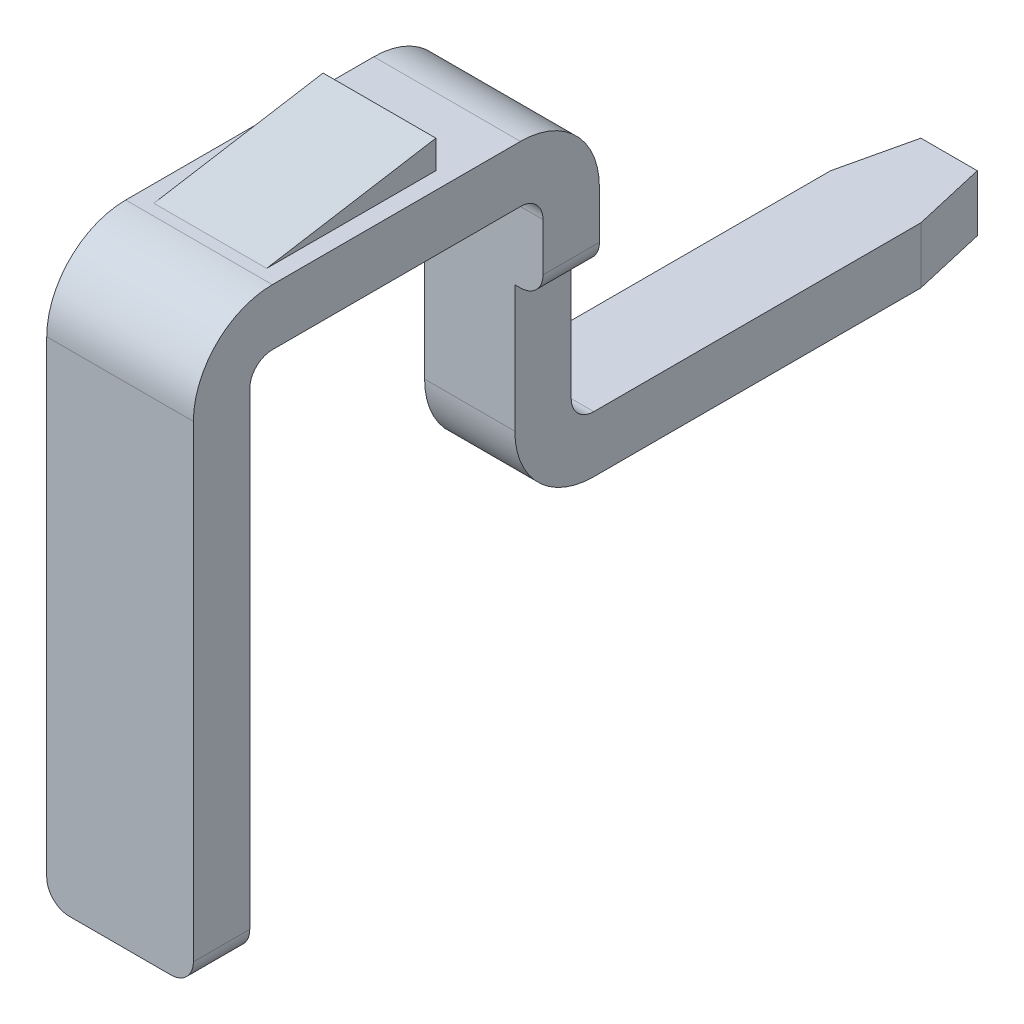
ISO-10303-21;
HEADER;
FILE_DESCRIPTION(('STEP AP214'),'2;1');
FILE_NAME('part.step','',(''),(''),'','','');
FILE_SCHEMA(('AUTOMOTIVE_DESIGN { 1 0 10303 214 1 1 1 1 }'));
ENDSEC;
DATA;
#1=APPLICATION_CONTEXT('core data for automotive mechanical design processes');
#2=APPLICATION_PROTOCOL_DEFINITION('international standard','automotive_design',2000,#1);
#3=PRODUCT_CONTEXT('',#1,'mechanical');
#4=PRODUCT('Part','Part','',(#3));
#5=PRODUCT_RELATED_PRODUCT_CATEGORY('part','',(#4));
#6=PRODUCT_DEFINITION_FORMATION('','',#4);
#7=PRODUCT_DEFINITION_CONTEXT('part definition',#1,'design');
#8=PRODUCT_DEFINITION('design','',#6,#7);
#9=PRODUCT_DEFINITION_SHAPE('','',#8);
#10=(LENGTH_UNIT() NAMED_UNIT(*) SI_UNIT(.MILLI.,.METRE.));
#11=(NAMED_UNIT(*) PLANE_ANGLE_UNIT() SI_UNIT($,.RADIAN.));
#12=(NAMED_UNIT(*) SI_UNIT($,.STERADIAN.) SOLID_ANGLE_UNIT());
#13=UNCERTAINTY_MEASURE_WITH_UNIT(LENGTH_MEASURE(1.E-05),#10,'distance_accuracy_value','');
#14=(GEOMETRIC_REPRESENTATION_CONTEXT(3) GLOBAL_UNCERTAINTY_ASSIGNED_CONTEXT((#13)) GLOBAL_UNIT_ASSIGNED_CONTEXT((#10,
#11,#12)) REPRESENTATION_CONTEXT('',''));
#15=CARTESIAN_POINT('',(0.,0.,0.));
#16=DIRECTION('',(0.,0.,1.));
#17=DIRECTION('',(1.,0.,0.));
#18=AXIS2_PLACEMENT_3D('',#15,#16,#17);
#19=CARTESIAN_POINT('',(-0.45,-1.95,3.8));
#20=DIRECTION('',(0.,0.,1.));
#21=DIRECTION('',(1.,0.,0.));
#22=AXIS2_PLACEMENT_3D('',#19,#20,#21);
#23=CYLINDRICAL_SURFACE('',#22,0.2);
#24=CARTESIAN_POINT('',(-0.45,-1.95,3.8));
#25=DIRECTION('',(0.,0.,1.));
#26=DIRECTION('',(1.,0.,0.));
#27=AXIS2_PLACEMENT_3D('',#24,#25,#26);
#28=CIRCLE('',#27,0.2);
#29=CARTESIAN_POINT('',(-0.65,-1.95,3.8));
#30=VERTEX_POINT('',#29);
#31=CARTESIAN_POINT('',(-0.45,-2.15,3.8));
#32=VERTEX_POINT('',#31);
#33=EDGE_CURVE('E334',#30,#32,#28,.T.);
#34=ORIENTED_EDGE('',*,*,#33,.F.);
#35=DIRECTION('',(0.,0.,1.));
#36=VECTOR('',#35,1.);
#37=CARTESIAN_POINT('',(-0.65,-1.95,3.8));
#38=LINE('',#37,#36);
#39=CARTESIAN_POINT('',(-0.65,-1.95,3.3));
#40=VERTEX_POINT('',#39);
#41=EDGE_CURVE('E313',#40,#30,#38,.T.);
#42=ORIENTED_EDGE('',*,*,#41,.F.);
#43=CARTESIAN_POINT('',(-0.45,-1.95,3.3));
#44=DIRECTION('',(0.,0.,-1.));
#45=DIRECTION('',(-1.,0.,0.));
#46=AXIS2_PLACEMENT_3D('',#43,#44,#45);
#47=CIRCLE('',#46,0.2);
#48=CARTESIAN_POINT('',(-0.45,-2.15,3.3));
#49=VERTEX_POINT('',#48);
#50=EDGE_CURVE('E463',#49,#40,#47,.T.);
#51=ORIENTED_EDGE('',*,*,#50,.F.);
#52=DIRECTION('',(0.,0.,-1.));
#53=VECTOR('',#52,1.);
#54=CARTESIAN_POINT('',(-0.45,-2.15,3.3));
#55=LINE('',#54,#53);
#56=EDGE_CURVE('E398',#32,#49,#55,.T.);
#57=ORIENTED_EDGE('',*,*,#56,.F.);
#58=EDGE_LOOP('',(#34,#42,#51,#57));
#59=FACE_BOUND('',#58,.T.);
#60=ADVANCED_FACE('F16',(#59),#23,.T.);
#61=CARTESIAN_POINT('',(0.45,-1.95,0.7));
#62=DIRECTION('',(0.,0.,1.));
#63=DIRECTION('',(1.,0.,0.));
#64=AXIS2_PLACEMENT_3D('',#61,#62,#63);
#65=CYLINDRICAL_SURFACE('',#64,0.2);
#66=CARTESIAN_POINT('',(0.45,-1.95,3.8));
#67=DIRECTION('',(0.,0.,1.));
#68=DIRECTION('',(1.,0.,0.));
#69=AXIS2_PLACEMENT_3D('',#66,#67,#68);
#70=CIRCLE('',#69,0.2);
#71=CARTESIAN_POINT('',(0.45,-2.15,3.8));
#72=VERTEX_POINT('',#71);
#73=CARTESIAN_POINT('',(0.65,-1.95,3.8));
#74=VERTEX_POINT('',#73);
#75=EDGE_CURVE('E423',#72,#74,#70,.T.);
#76=ORIENTED_EDGE('',*,*,#75,.F.);
#77=DIRECTION('',(0.,0.,1.));
#78=VECTOR('',#77,1.);
#79=CARTESIAN_POINT('',(0.45,-2.15,3.8));
#80=LINE('',#79,#78);
#81=CARTESIAN_POINT('',(0.45,-2.15,3.3));
#82=VERTEX_POINT('',#81);
#83=EDGE_CURVE('E289',#82,#72,#80,.T.);
#84=ORIENTED_EDGE('',*,*,#83,.F.);
#85=CARTESIAN_POINT('',(0.45,-1.95,3.3));
#86=DIRECTION('',(0.,0.,-1.));
#87=DIRECTION('',(-1.,0.,0.));
#88=AXIS2_PLACEMENT_3D('',#85,#86,#87);
#89=CIRCLE('',#88,0.2);
#90=CARTESIAN_POINT('',(0.65,-1.95,3.3));
#91=VERTEX_POINT('',#90);
#92=EDGE_CURVE('E462',#91,#82,#89,.T.);
#93=ORIENTED_EDGE('',*,*,#92,.F.);
#94=DIRECTION('',(0.,0.,-1.));
#95=VECTOR('',#94,1.);
#96=CARTESIAN_POINT('',(0.65,-1.95,3.3));
#97=LINE('',#96,#95);
#98=EDGE_CURVE('E311',#74,#91,#97,.T.);
#99=ORIENTED_EDGE('',*,*,#98,.F.);
#100=EDGE_LOOP('',(#76,#84,#93,#99));
#101=FACE_BOUND('',#100,.T.);
#102=ADVANCED_FACE('F618',(#101),#65,.T.);
#103=CARTESIAN_POINT('',(-0.5,3.15,1.5));
#104=DIRECTION('',(0.,-0.986393923832144,-0.164398987305357));
#105=DIRECTION('',(0.,0.164398987305357,-0.986393923832144));
#106=AXIS2_PLACEMENT_3D('',#103,#104,#105);
#107=PLANE('',#106);
#108=DIRECTION('',(0.,0.164398987305357,-0.986393923832144));
#109=VECTOR('',#108,1.);
#110=CARTESIAN_POINT('',(0.5,3.15,1.5));
#111=LINE('',#110,#109);
#112=CARTESIAN_POINT('',(0.5,2.9,3.));
#113=VERTEX_POINT('',#112);
#114=CARTESIAN_POINT('',(0.5,3.15,1.5));
#115=VERTEX_POINT('',#114);
#116=EDGE_CURVE('E411',#113,#115,#111,.T.);
#117=ORIENTED_EDGE('',*,*,#116,.T.);
#118=DIRECTION('',(-1.,0.,0.));
#119=VECTOR('',#118,1.);
#120=CARTESIAN_POINT('',(0.5,3.15,1.5));
#121=LINE('',#120,#119);
#122=CARTESIAN_POINT('',(-0.5,3.15,1.5));
#123=VERTEX_POINT('',#122);
#124=EDGE_CURVE('E27',#115,#123,#121,.T.);
#125=ORIENTED_EDGE('',*,*,#124,.T.);
#126=DIRECTION('',(0.,0.164398987305357,-0.986393923832144));
#127=VECTOR('',#126,1.);
#128=CARTESIAN_POINT('',(-0.5,3.15,1.5));
#129=LINE('',#128,#127);
#130=CARTESIAN_POINT('',(-0.5,2.9,3.));
#131=VERTEX_POINT('',#130);
#132=EDGE_CURVE('E11',#131,#123,#129,.T.);
#133=ORIENTED_EDGE('',*,*,#132,.F.);
#134=DIRECTION('',(1.,0.,0.));
#135=VECTOR('',#134,1.);
#136=CARTESIAN_POINT('',(-0.5,2.9,3.));
#137=LINE('',#136,#135);
#138=EDGE_CURVE('E406',#131,#113,#137,.T.);
#139=ORIENTED_EDGE('',*,*,#138,.T.);
#140=EDGE_LOOP('',(#117,#125,#133,#139));
#141=FACE_BOUND('',#140,.T.);
#142=ADVANCED_FACE('F1175',(#141),#107,.F.);
#143=CARTESIAN_POINT('',(-0.5,3.15,1.5));
#144=DIRECTION('',(1.,0.,0.));
#145=DIRECTION('',(0.,0.,-1.));
#146=AXIS2_PLACEMENT_3D('',#143,#144,#145);
#147=PLANE('',#146);
#148=DIRECTION('',(0.,0.,1.));
#149=VECTOR('',#148,1.);
#150=CARTESIAN_POINT('',(-0.5,2.9,1.5));
#151=LINE('',#150,#149);
#152=CARTESIAN_POINT('',(-0.5,2.9,1.5));
#153=VERTEX_POINT('',#152);
#154=EDGE_CURVE('E422',#153,#131,#151,.T.);
#155=ORIENTED_EDGE('',*,*,#154,.T.);
#156=ORIENTED_EDGE('',*,*,#132,.T.);
#157=DIRECTION('',(0.,-1.,0.));
#158=VECTOR('',#157,1.);
#159=CARTESIAN_POINT('',(-0.5,3.15,1.5));
#160=LINE('',#159,#158);
#161=EDGE_CURVE('E286',#123,#153,#160,.T.);
#162=ORIENTED_EDGE('',*,*,#161,.T.);
#163=EDGE_LOOP('',(#155,#156,#162));
#164=FACE_BOUND('',#163,.T.);
#165=ADVANCED_FACE('F1165',(#164),#147,.F.);
#166=CARTESIAN_POINT('',(0.5,3.15,1.5));
#167=DIRECTION('',(0.,0.,1.));
#168=DIRECTION('',(1.,0.,0.));
#169=AXIS2_PLACEMENT_3D('',#166,#167,#168);
#170=PLANE('',#169);
#171=DIRECTION('',(-1.,0.,0.));
#172=VECTOR('',#171,1.);
#173=CARTESIAN_POINT('',(0.5,2.9,1.5));
#174=LINE('',#173,#172);
#175=CARTESIAN_POINT('',(0.5,2.9,1.5));
#176=VERTEX_POINT('',#175);
#177=EDGE_CURVE('E402',#176,#153,#174,.T.);
#178=ORIENTED_EDGE('',*,*,#177,.T.);
#179=ORIENTED_EDGE('',*,*,#161,.F.);
#180=ORIENTED_EDGE('',*,*,#124,.F.);
#181=DIRECTION('',(0.,-1.,0.));
#182=VECTOR('',#181,1.);
#183=CARTESIAN_POINT('',(0.5,3.15,1.5));
#184=LINE('',#183,#182);
#185=EDGE_CURVE('E358',#115,#176,#184,.T.);
#186=ORIENTED_EDGE('',*,*,#185,.T.);
#187=EDGE_LOOP('',(#178,#179,#180,#186));
#188=FACE_BOUND('',#187,.T.);
#189=ADVANCED_FACE('F1156',(#188),#170,.F.);
#190=CARTESIAN_POINT('',(0.4,-0.25,-2.9));
#191=DIRECTION('',(-0.97439119569462,0.,0.224859506698758));
#192=DIRECTION('',(0.,1.,0.));
#193=AXIS2_PLACEMENT_3D('',#190,#191,#192);
#194=PLANE('',#193);
#195=DIRECTION('',(0.224859506698758,0.,0.97439119569462));
#196=VECTOR('',#195,1.);
#197=CARTESIAN_POINT('',(0.4,-0.25,-2.9));
#198=LINE('',#197,#196);
#199=CARTESIAN_POINT('',(0.25,-0.25,-3.55));
#200=VERTEX_POINT('',#199);
#201=CARTESIAN_POINT('',(0.4,-0.25,-2.9));
#202=VERTEX_POINT('',#201);
#203=EDGE_CURVE('E365',#200,#202,#198,.T.);
#204=ORIENTED_EDGE('',*,*,#203,.F.);
#205=DIRECTION('',(0.,-1.,0.));
#206=VECTOR('',#205,1.);
#207=CARTESIAN_POINT('',(0.25,0.,-3.55));
#208=LINE('',#207,#206);
#209=CARTESIAN_POINT('',(0.25,0.25,-3.55));
#210=VERTEX_POINT('',#209);
#211=EDGE_CURVE('E433',#210,#200,#208,.T.);
#212=ORIENTED_EDGE('',*,*,#211,.F.);
#213=DIRECTION('',(-0.224859506698758,0.,-0.97439119569462));
#214=VECTOR('',#213,1.);
#215=CARTESIAN_POINT('',(0.4,0.25,-2.9));
#216=LINE('',#215,#214);
#217=CARTESIAN_POINT('',(0.4,0.25,-2.9));
#218=VERTEX_POINT('',#217);
#219=EDGE_CURVE('E285',#218,#210,#216,.T.);
#220=ORIENTED_EDGE('',*,*,#219,.F.);
#221=DIRECTION('',(0.,1.,0.));
#222=VECTOR('',#221,1.);
#223=CARTESIAN_POINT('',(0.4,-0.25,-2.9));
#224=LINE('',#223,#222);
#225=EDGE_CURVE('E262',#202,#218,#224,.T.);
#226=ORIENTED_EDGE('',*,*,#225,.F.);
#227=EDGE_LOOP('',(#204,#212,#220,#226));
#228=FACE_BOUND('',#227,.T.);
#229=ADVANCED_FACE('F1146',(#228),#194,.F.);
#230=CARTESIAN_POINT('',(-0.4,0.25,-2.9));
#231=DIRECTION('',(0.97439119569462,0.,0.224859506698758));
#232=DIRECTION('',(0.,-1.,0.));
#233=AXIS2_PLACEMENT_3D('',#230,#231,#232);
#234=PLANE('',#233);
#235=DIRECTION('',(-0.224859506698758,0.,0.97439119569462));
#236=VECTOR('',#235,1.);
#237=CARTESIAN_POINT('',(-0.4,0.25,-2.9));
#238=LINE('',#237,#236);
#239=CARTESIAN_POINT('',(-0.25,0.25,-3.55));
#240=VERTEX_POINT('',#239);
#241=CARTESIAN_POINT('',(-0.4,0.25,-2.9));
#242=VERTEX_POINT('',#241);
#243=EDGE_CURVE('E374',#240,#242,#238,.T.);
#244=ORIENTED_EDGE('',*,*,#243,.F.);
#245=DIRECTION('',(0.,1.,0.));
#246=VECTOR('',#245,1.);
#247=CARTESIAN_POINT('',(-0.25,0.,-3.55));
#248=LINE('',#247,#246);
#249=CARTESIAN_POINT('',(-0.25,-0.25,-3.55));
#250=VERTEX_POINT('',#249);
#251=EDGE_CURVE('E430',#250,#240,#248,.T.);
#252=ORIENTED_EDGE('',*,*,#251,.F.);
#253=DIRECTION('',(0.224859506698758,0.,-0.97439119569462));
#254=VECTOR('',#253,1.);
#255=CARTESIAN_POINT('',(-0.4,-0.25,-2.9));
#256=LINE('',#255,#254);
#257=CARTESIAN_POINT('',(-0.4,-0.25,-2.9));
#258=VERTEX_POINT('',#257);
#259=EDGE_CURVE('E280',#258,#250,#256,.T.);
#260=ORIENTED_EDGE('',*,*,#259,.F.);
#261=DIRECTION('',(0.,-1.,0.));
#262=VECTOR('',#261,1.);
#263=CARTESIAN_POINT('',(-0.4,0.25,-2.9));
#264=LINE('',#263,#262);
#265=EDGE_CURVE('E329',#242,#258,#264,.T.);
#266=ORIENTED_EDGE('',*,*,#265,.F.);
#267=EDGE_LOOP('',(#244,#252,#260,#266));
#268=FACE_BOUND('',#267,.T.);
#269=ADVANCED_FACE('F1137',(#268),#234,.F.);
#270=CARTESIAN_POINT('',(0.4,2.2,0.9));
#271=DIRECTION('',(-1.,0.,0.));
#272=DIRECTION('',(0.,0.,1.));
#273=AXIS2_PLACEMENT_3D('',#270,#271,#272);
#274=CYLINDRICAL_SURFACE('',#273,0.7);
#275=CARTESIAN_POINT('',(0.65,2.2,0.9));
#276=DIRECTION('',(1.,0.,0.));
#277=DIRECTION('',(0.,0.,1.));
#278=AXIS2_PLACEMENT_3D('',#275,#276,#277);
#279=CIRCLE('',#278,0.7);
#280=CARTESIAN_POINT('',(0.65,2.2,0.2));
#281=VERTEX_POINT('',#280);
#282=CARTESIAN_POINT('',(0.65,2.9,0.9));
#283=VERTEX_POINT('',#282);
#284=EDGE_CURVE('E429',#281,#283,#279,.T.);
#285=ORIENTED_EDGE('',*,*,#284,.F.);
#286=DIRECTION('',(1.,0.,0.));
#287=VECTOR('',#286,1.);
#288=CARTESIAN_POINT('',(0.4,2.2,0.2));
#289=LINE('',#288,#287);
#290=CARTESIAN_POINT('',(-0.65,2.2,0.2));
#291=VERTEX_POINT('',#290);
#292=EDGE_CURVE('E383',#291,#281,#289,.T.);
#293=ORIENTED_EDGE('',*,*,#292,.F.);
#294=CARTESIAN_POINT('',(-0.65,2.2,0.9));
#295=DIRECTION('',(-1.,0.,0.));
#296=DIRECTION('',(0.,0.,-1.));
#297=AXIS2_PLACEMENT_3D('',#294,#295,#296);
#298=CIRCLE('',#297,0.7);
#299=CARTESIAN_POINT('',(-0.65,2.9,0.9));
#300=VERTEX_POINT('',#299);
#301=EDGE_CURVE('E357',#300,#291,#298,.T.);
#302=ORIENTED_EDGE('',*,*,#301,.F.);
#303=DIRECTION('',(-1.,0.,0.));
#304=VECTOR('',#303,1.);
#305=CARTESIAN_POINT('',(0.4,2.9,0.9));
#306=LINE('',#305,#304);
#307=EDGE_CURVE('E302',#283,#300,#306,.T.);
#308=ORIENTED_EDGE('',*,*,#307,.F.);
#309=EDGE_LOOP('',(#285,#293,#302,#308));
#310=FACE_BOUND('',#309,.T.);
#311=ADVANCED_FACE('F650',(#310),#274,.T.);
#312=CARTESIAN_POINT('',(0.,2.2,3.1));
#313=DIRECTION('',(1.,0.,0.));
#314=DIRECTION('',(0.,0.,-1.));
#315=AXIS2_PLACEMENT_3D('',#312,#313,#314);
#316=CYLINDRICAL_SURFACE('',#315,0.7);
#317=CARTESIAN_POINT('',(0.65,2.2,3.1));
#318=DIRECTION('',(1.,0.,0.));
#319=DIRECTION('',(0.,0.,1.));
#320=AXIS2_PLACEMENT_3D('',#317,#318,#319);
#321=CIRCLE('',#320,0.7);
#322=CARTESIAN_POINT('',(0.65,2.9,3.1));
#323=VERTEX_POINT('',#322);
#324=CARTESIAN_POINT('',(0.65,2.2,3.8));
#325=VERTEX_POINT('',#324);
#326=EDGE_CURVE('E473',#323,#325,#321,.T.);
#327=ORIENTED_EDGE('',*,*,#326,.F.);
#328=DIRECTION('',(1.,0.,0.));
#329=VECTOR('',#328,1.);
#330=CARTESIAN_POINT('',(0.6,2.9,3.1));
#331=LINE('',#330,#329);
#332=CARTESIAN_POINT('',(-0.65,2.9,3.1));
#333=VERTEX_POINT('',#332);
#334=EDGE_CURVE('E407',#333,#323,#331,.T.);
#335=ORIENTED_EDGE('',*,*,#334,.F.);
#336=CARTESIAN_POINT('',(-0.65,2.2,3.1));
#337=DIRECTION('',(-1.,0.,0.));
#338=DIRECTION('',(0.,0.,-1.));
#339=AXIS2_PLACEMENT_3D('',#336,#337,#338);
#340=CIRCLE('',#339,0.7);
#341=CARTESIAN_POINT('',(-0.65,2.2,3.8));
#342=VERTEX_POINT('',#341);
#343=EDGE_CURVE('E316',#342,#333,#340,.T.);
#344=ORIENTED_EDGE('',*,*,#343,.F.);
#345=DIRECTION('',(-1.,0.,0.));
#346=VECTOR('',#345,1.);
#347=CARTESIAN_POINT('',(-0.6,2.2,3.8));
#348=LINE('',#347,#346);
#349=EDGE_CURVE('E307',#325,#342,#348,.T.);
#350=ORIENTED_EDGE('',*,*,#349,.F.);
#351=EDGE_LOOP('',(#327,#335,#344,#350));
#352=FACE_BOUND('',#351,.T.);
#353=ADVANCED_FACE('F1118',(#352),#316,.T.);
#354=CARTESIAN_POINT('',(0.,0.45,0.));
#355=DIRECTION('',(-1.,0.,0.));
#356=DIRECTION('',(0.,0.,1.));
#357=AXIS2_PLACEMENT_3D('',#354,#355,#356);
#358=CYLINDRICAL_SURFACE('',#357,0.7);
#359=CARTESIAN_POINT('',(-0.4,0.45,0.));
#360=DIRECTION('',(-1.,0.,0.));
#361=DIRECTION('',(0.,0.,-1.));
#362=AXIS2_PLACEMENT_3D('',#359,#360,#361);
#363=CIRCLE('',#362,0.7);
#364=CARTESIAN_POINT('',(-0.4,-0.25,0.));
#365=VERTEX_POINT('',#364);
#366=CARTESIAN_POINT('',(-0.4,0.45,0.7));
#367=VERTEX_POINT('',#366);
#368=EDGE_CURVE('E328',#365,#367,#363,.T.);
#369=ORIENTED_EDGE('',*,*,#368,.F.);
#370=DIRECTION('',(-1.,0.,0.));
#371=VECTOR('',#370,1.);
#372=CARTESIAN_POINT('',(-0.4,-0.25,0.));
#373=LINE('',#372,#371);
#374=CARTESIAN_POINT('',(0.4,-0.25,0.));
#375=VERTEX_POINT('',#374);
#376=EDGE_CURVE('E268',#375,#365,#373,.T.);
#377=ORIENTED_EDGE('',*,*,#376,.F.);
#378=CARTESIAN_POINT('',(0.4,0.45,0.));
#379=DIRECTION('',(1.,0.,0.));
#380=DIRECTION('',(0.,0.,1.));
#381=AXIS2_PLACEMENT_3D('',#378,#379,#380);
#382=CIRCLE('',#381,0.7);
#383=CARTESIAN_POINT('',(0.4,0.45,0.7));
#384=VERTEX_POINT('',#383);
#385=EDGE_CURVE('E254',#384,#375,#382,.T.);
#386=ORIENTED_EDGE('',*,*,#385,.F.);
#387=DIRECTION('',(1.,0.,0.));
#388=VECTOR('',#387,1.);
#389=CARTESIAN_POINT('',(0.4,0.45,0.7));
#390=LINE('',#389,#388);
#391=EDGE_CURVE('E369',#367,#384,#390,.T.);
#392=ORIENTED_EDGE('',*,*,#391,.F.);
#393=EDGE_LOOP('',(#369,#377,#386,#392));
#394=FACE_BOUND('',#393,.T.);
#395=ADVANCED_FACE('F1108',(#394),#358,.T.);
#396=CARTESIAN_POINT('',(0.,2.2,0.9));
#397=DIRECTION('',(1.,0.,0.));
#398=DIRECTION('',(0.,1.,0.));
#399=AXIS2_PLACEMENT_3D('',#396,#397,#398);
#400=CYLINDRICAL_SURFACE('',#399,0.2);
#401=CARTESIAN_POINT('',(0.65,2.2,0.9));
#402=DIRECTION('',(-1.,0.,0.));
#403=DIRECTION('',(0.,0.,1.));
#404=AXIS2_PLACEMENT_3D('',#401,#402,#403);
#405=CIRCLE('',#404,0.2);
#406=CARTESIAN_POINT('',(0.65,2.4,0.9));
#407=VERTEX_POINT('',#406);
#408=CARTESIAN_POINT('',(0.65,2.2,0.7));
#409=VERTEX_POINT('',#408);
#410=EDGE_CURVE('E346',#407,#409,#405,.T.);
#411=ORIENTED_EDGE('',*,*,#410,.F.);
#412=DIRECTION('',(1.,0.,0.));
#413=VECTOR('',#412,1.);
#414=CARTESIAN_POINT('',(0.6,2.4,0.9));
#415=LINE('',#414,#413);
#416=CARTESIAN_POINT('',(-0.65,2.4,0.9));
#417=VERTEX_POINT('',#416);
#418=EDGE_CURVE('E384',#417,#407,#415,.T.);
#419=ORIENTED_EDGE('',*,*,#418,.F.);
#420=CARTESIAN_POINT('',(-0.65,2.2,0.9));
#421=DIRECTION('',(1.,0.,0.));
#422=DIRECTION('',(0.,0.,-1.));
#423=AXIS2_PLACEMENT_3D('',#420,#421,#422);
#424=CIRCLE('',#423,0.2);
#425=CARTESIAN_POINT('',(-0.65,2.2,0.7));
#426=VERTEX_POINT('',#425);
#427=EDGE_CURVE('E458',#426,#417,#424,.T.);
#428=ORIENTED_EDGE('',*,*,#427,.F.);
#429=DIRECTION('',(-1.,0.,0.));
#430=VECTOR('',#429,1.);
#431=CARTESIAN_POINT('',(-0.6,2.2,0.7));
#432=LINE('',#431,#430);
#433=EDGE_CURVE('E274',#409,#426,#432,.T.);
#434=ORIENTED_EDGE('',*,*,#433,.F.);
#435=EDGE_LOOP('',(#411,#419,#428,#434));
#436=FACE_BOUND('',#435,.T.);
#437=ADVANCED_FACE('F636',(#436),#400,.F.);
#438=CARTESIAN_POINT('',(0.,2.2,3.1));
#439=DIRECTION('',(1.,0.,0.));
#440=DIRECTION('',(0.,1.,0.));
#441=AXIS2_PLACEMENT_3D('',#438,#439,#440);
#442=CYLINDRICAL_SURFACE('',#441,0.2);
#443=CARTESIAN_POINT('',(0.65,2.2,3.1));
#444=DIRECTION('',(-1.,0.,0.));
#445=DIRECTION('',(0.,0.,1.));
#446=AXIS2_PLACEMENT_3D('',#443,#444,#445);
#447=CIRCLE('',#446,0.2);
#448=CARTESIAN_POINT('',(0.65,2.2,3.3));
#449=VERTEX_POINT('',#448);
#450=CARTESIAN_POINT('',(0.65,2.4,3.1));
#451=VERTEX_POINT('',#450);
#452=EDGE_CURVE('E351',#449,#451,#447,.T.);
#453=ORIENTED_EDGE('',*,*,#452,.F.);
#454=DIRECTION('',(1.,0.,0.));
#455=VECTOR('',#454,1.);
#456=CARTESIAN_POINT('',(0.6,2.2,3.3));
#457=LINE('',#456,#455);
#458=CARTESIAN_POINT('',(-0.65,2.2,3.3));
#459=VERTEX_POINT('',#458);
#460=EDGE_CURVE('E459',#459,#449,#457,.T.);
#461=ORIENTED_EDGE('',*,*,#460,.F.);
#462=CARTESIAN_POINT('',(-0.65,2.2,3.1));
#463=DIRECTION('',(1.,0.,0.));
#464=DIRECTION('',(0.,0.,-1.));
#465=AXIS2_PLACEMENT_3D('',#462,#463,#464);
#466=CIRCLE('',#465,0.2);
#467=CARTESIAN_POINT('',(-0.65,2.4,3.1));
#468=VERTEX_POINT('',#467);
#469=EDGE_CURVE('E453',#468,#459,#466,.T.);
#470=ORIENTED_EDGE('',*,*,#469,.F.);
#471=DIRECTION('',(-1.,0.,0.));
#472=VECTOR('',#471,1.);
#473=CARTESIAN_POINT('',(-0.6,2.4,3.1));
#474=LINE('',#473,#472);
#475=EDGE_CURVE('E415',#451,#468,#474,.T.);
#476=ORIENTED_EDGE('',*,*,#475,.F.);
#477=EDGE_LOOP('',(#453,#461,#470,#476));
#478=FACE_BOUND('',#477,.T.);
#479=ADVANCED_FACE('F548',(#478),#442,.F.);
#480=CARTESIAN_POINT('',(0.45,1.775,0.2));
#481=DIRECTION('',(0.,0.,1.));
#482=DIRECTION('',(1.,0.,0.));
#483=AXIS2_PLACEMENT_3D('',#480,#481,#482);
#484=CYLINDRICAL_SURFACE('',#483,0.2);
#485=CARTESIAN_POINT('',(0.45,1.775,0.2));
#486=DIRECTION('',(0.,0.,-1.));
#487=DIRECTION('',(1.,0.,0.));
#488=AXIS2_PLACEMENT_3D('',#485,#486,#487);
#489=CIRCLE('',#488,0.2);
#490=CARTESIAN_POINT('',(0.65,1.775,0.2));
#491=VERTEX_POINT('',#490);
#492=CARTESIAN_POINT('',(0.449997009541553,1.575,0.2));
#493=VERTEX_POINT('',#492);
#494=EDGE_CURVE('E242',#491,#493,#489,.T.);
#495=ORIENTED_EDGE('',*,*,#494,.F.);
#496=DIRECTION('',(0.,0.,-1.));
#497=VECTOR('',#496,1.);
#498=CARTESIAN_POINT('',(0.65,1.775,0.7));
#499=LINE('',#498,#497);
#500=CARTESIAN_POINT('',(0.65,1.775,0.7));
#501=VERTEX_POINT('',#500);
#502=EDGE_CURVE('E350',#501,#491,#499,.T.);
#503=ORIENTED_EDGE('',*,*,#502,.F.);
#504=CARTESIAN_POINT('',(0.45,1.775,0.7));
#505=DIRECTION('',(0.,0.,1.));
#506=DIRECTION('',(1.,0.,0.));
#507=AXIS2_PLACEMENT_3D('',#504,#505,#506);
#508=CIRCLE('',#507,0.2);
#509=CARTESIAN_POINT('',(0.449997009541553,1.575,0.7));
#510=VERTEX_POINT('',#509);
#511=EDGE_CURVE('E416',#510,#501,#508,.T.);
#512=ORIENTED_EDGE('',*,*,#511,.F.);
#513=DIRECTION('',(0.,0.,-1.));
#514=VECTOR('',#513,1.);
#515=CARTESIAN_POINT('',(0.45,1.575,0.45));
#516=LINE('',#515,#514);
#517=EDGE_CURVE('E489',#510,#493,#516,.T.);
#518=ORIENTED_EDGE('',*,*,#517,.T.);
#519=EDGE_LOOP('',(#495,#503,#512,#518));
#520=FACE_BOUND('',#519,.T.);
#521=ADVANCED_FACE('F644',(#520),#484,.T.);
#522=CARTESIAN_POINT('',(-0.45,1.775,0.7));
#523=DIRECTION('',(0.,0.,-1.));
#524=DIRECTION('',(-1.,0.,0.));
#525=AXIS2_PLACEMENT_3D('',#522,#523,#524);
#526=CYLINDRICAL_SURFACE('',#525,0.2);
#527=CARTESIAN_POINT('',(-0.45,1.775,0.2));
#528=DIRECTION('',(0.,0.,-1.));
#529=DIRECTION('',(1.,0.,0.));
#530=AXIS2_PLACEMENT_3D('',#527,#528,#529);
#531=CIRCLE('',#530,0.2);
#532=CARTESIAN_POINT('',(-0.449997009541553,1.575,0.2));
#533=VERTEX_POINT('',#532);
#534=CARTESIAN_POINT('',(-0.65,1.775,0.2));
#535=VERTEX_POINT('',#534);
#536=EDGE_CURVE('E241',#533,#535,#531,.T.);
#537=ORIENTED_EDGE('',*,*,#536,.F.);
#538=DIRECTION('',(0.,0.,1.));
#539=VECTOR('',#538,1.);
#540=CARTESIAN_POINT('',(-0.45,1.575,0.45));
#541=LINE('',#540,#539);
#542=CARTESIAN_POINT('',(-0.449997009541553,1.575,0.7));
#543=VERTEX_POINT('',#542);
#544=EDGE_CURVE('E436',#533,#543,#541,.T.);
#545=ORIENTED_EDGE('',*,*,#544,.T.);
#546=CARTESIAN_POINT('',(-0.45,1.775,0.7));
#547=DIRECTION('',(0.,0.,1.));
#548=DIRECTION('',(1.,0.,0.));
#549=AXIS2_PLACEMENT_3D('',#546,#547,#548);
#550=CIRCLE('',#549,0.2);
#551=CARTESIAN_POINT('',(-0.65,1.775,0.7));
#552=VERTEX_POINT('',#551);
#553=EDGE_CURVE('E293',#552,#543,#550,.T.);
#554=ORIENTED_EDGE('',*,*,#553,.F.);
#555=DIRECTION('',(0.,0.,1.));
#556=VECTOR('',#555,1.);
#557=CARTESIAN_POINT('',(-0.65,1.775,0.7));
#558=LINE('',#557,#556);
#559=EDGE_CURVE('E442',#535,#552,#558,.T.);
#560=ORIENTED_EDGE('',*,*,#559,.F.);
#561=EDGE_LOOP('',(#537,#545,#554,#560));
#562=FACE_BOUND('',#561,.T.);
#563=ADVANCED_FACE('F1071',(#562),#526,.T.);
#564=CARTESIAN_POINT('',(0.4,0.45,0.));
#565=DIRECTION('',(1.,0.,0.));
#566=DIRECTION('',(0.,0.,-1.));
#567=AXIS2_PLACEMENT_3D('',#564,#565,#566);
#568=CYLINDRICAL_SURFACE('',#567,0.2);
#569=CARTESIAN_POINT('',(0.4,0.45,0.));
#570=DIRECTION('',(-1.,0.,0.));
#571=DIRECTION('',(0.,0.,1.));
#572=AXIS2_PLACEMENT_3D('',#569,#570,#571);
#573=CIRCLE('',#572,0.2);
#574=CARTESIAN_POINT('',(0.4,0.25,0.));
#575=VERTEX_POINT('',#574);
#576=CARTESIAN_POINT('',(0.4,0.45,0.2));
#577=VERTEX_POINT('',#576);
#578=EDGE_CURVE('E234',#575,#577,#573,.T.);
#579=ORIENTED_EDGE('',*,*,#578,.F.);
#580=DIRECTION('',(1.,0.,0.));
#581=VECTOR('',#580,1.);
#582=CARTESIAN_POINT('',(0.4,0.25,0.));
#583=LINE('',#582,#581);
#584=CARTESIAN_POINT('',(-0.4,0.25,0.));
#585=VERTEX_POINT('',#584);
#586=EDGE_CURVE('E377',#585,#575,#583,.T.);
#587=ORIENTED_EDGE('',*,*,#586,.F.);
#588=CARTESIAN_POINT('',(-0.4,0.45,0.));
#589=DIRECTION('',(1.,0.,0.));
#590=DIRECTION('',(0.,0.,-1.));
#591=AXIS2_PLACEMENT_3D('',#588,#589,#590);
#592=CIRCLE('',#591,0.2);
#593=CARTESIAN_POINT('',(-0.4,0.45,0.2));
#594=VERTEX_POINT('',#593);
#595=EDGE_CURVE('E237',#594,#585,#592,.T.);
#596=ORIENTED_EDGE('',*,*,#595,.F.);
#597=DIRECTION('',(-1.,0.,0.));
#598=VECTOR('',#597,1.);
#599=CARTESIAN_POINT('',(-0.4,0.45,0.2));
#600=LINE('',#599,#598);
#601=EDGE_CURVE('E230',#577,#594,#600,.T.);
#602=ORIENTED_EDGE('',*,*,#601,.F.);
#603=EDGE_LOOP('',(#579,#587,#596,#602));
#604=FACE_BOUND('',#603,.T.);
#605=ADVANCED_FACE('F232',(#604),#568,.F.);
#606=CARTESIAN_POINT('',(0.,-2.15,3.8));
#607=DIRECTION('',(0.,-1.,0.));
#608=DIRECTION('',(-1.,0.,0.));
#609=AXIS2_PLACEMENT_3D('',#606,#607,#608);
#610=PLANE('',#609);
#611=DIRECTION('',(-1.,0.,0.));
#612=VECTOR('',#611,1.);
#613=CARTESIAN_POINT('',(0.,-2.15,3.8));
#614=LINE('',#613,#612);
#615=EDGE_CURVE('E338',#72,#32,#614,.T.);
#616=ORIENTED_EDGE('',*,*,#615,.T.);
#617=ORIENTED_EDGE('',*,*,#56,.T.);
#618=DIRECTION('',(-1.,0.,0.));
#619=VECTOR('',#618,1.);
#620=CARTESIAN_POINT('',(0.,-2.15,3.3));
#621=LINE('',#620,#619);
#622=EDGE_CURVE('E457',#82,#49,#621,.T.);
#623=ORIENTED_EDGE('',*,*,#622,.F.);
#624=ORIENTED_EDGE('',*,*,#83,.T.);
#625=EDGE_LOOP('',(#616,#617,#623,#624));
#626=FACE_BOUND('',#625,.T.);
#627=ADVANCED_FACE('F627',(#626),#610,.T.);
#628=CARTESIAN_POINT('',(0.,-1.9,3.3));
#629=DIRECTION('',(0.,0.,-1.));
#630=DIRECTION('',(0.,-1.,0.));
#631=AXIS2_PLACEMENT_3D('',#628,#629,#630);
#632=PLANE('',#631);
#633=ORIENTED_EDGE('',*,*,#622,.T.);
#634=ORIENTED_EDGE('',*,*,#50,.T.);
#635=DIRECTION('',(0.,1.,0.));
#636=VECTOR('',#635,1.);
#637=CARTESIAN_POINT('',(-0.65,0.25,3.3));
#638=LINE('',#637,#636);
#639=EDGE_CURVE('E317',#40,#459,#638,.T.);
#640=ORIENTED_EDGE('',*,*,#639,.T.);
#641=ORIENTED_EDGE('',*,*,#460,.T.);
#642=DIRECTION('',(0.,1.,0.));
#643=VECTOR('',#642,1.);
#644=CARTESIAN_POINT('',(0.65,-0.25,3.3));
#645=LINE('',#644,#643);
#646=EDGE_CURVE('E389',#91,#449,#645,.T.);
#647=ORIENTED_EDGE('',*,*,#646,.F.);
#648=ORIENTED_EDGE('',*,*,#92,.T.);
#649=EDGE_LOOP('',(#633,#634,#640,#641,#647,#648));
#650=FACE_BOUND('',#649,.T.);
#651=ADVANCED_FACE('F533',(#650),#632,.T.);
#652=CARTESIAN_POINT('',(-0.65,0.25,0.7));
#653=DIRECTION('',(1.,0.,0.));
#654=DIRECTION('',(0.,1.,0.));
#655=AXIS2_PLACEMENT_3D('',#652,#653,#654);
#656=PLANE('',#655);
#657=ORIENTED_EDGE('',*,*,#639,.F.);
#658=ORIENTED_EDGE('',*,*,#41,.T.);
#659=DIRECTION('',(0.,-1.,0.));
#660=VECTOR('',#659,1.);
#661=CARTESIAN_POINT('',(-0.65,0.25,3.8));
#662=LINE('',#661,#660);
#663=EDGE_CURVE('E339',#342,#30,#662,.T.);
#664=ORIENTED_EDGE('',*,*,#663,.F.);
#665=ORIENTED_EDGE('',*,*,#343,.T.);
#666=DIRECTION('',(0.,0.,-1.));
#667=VECTOR('',#666,1.);
#668=CARTESIAN_POINT('',(-0.65,2.9,0.7));
#669=LINE('',#668,#667);
#670=EDGE_CURVE('E306',#333,#300,#669,.T.);
#671=ORIENTED_EDGE('',*,*,#670,.T.);
#672=ORIENTED_EDGE('',*,*,#301,.T.);
#673=DIRECTION('',(0.,-1.,0.));
#674=VECTOR('',#673,1.);
#675=CARTESIAN_POINT('',(-0.65,0.25,0.2));
#676=LINE('',#675,#674);
#677=EDGE_CURVE('E440',#291,#535,#676,.T.);
#678=ORIENTED_EDGE('',*,*,#677,.T.);
#679=ORIENTED_EDGE('',*,*,#559,.T.);
#680=DIRECTION('',(0.,-1.,0.));
#681=VECTOR('',#680,1.);
#682=CARTESIAN_POINT('',(-0.65,0.25,0.7));
#683=LINE('',#682,#681);
#684=EDGE_CURVE('E278',#426,#552,#683,.T.);
#685=ORIENTED_EDGE('',*,*,#684,.F.);
#686=ORIENTED_EDGE('',*,*,#427,.T.);
#687=DIRECTION('',(0.,0.,-1.));
#688=VECTOR('',#687,1.);
#689=CARTESIAN_POINT('',(-0.65,2.4,0.7));
#690=LINE('',#689,#688);
#691=EDGE_CURVE('E272',#468,#417,#690,.T.);
#692=ORIENTED_EDGE('',*,*,#691,.F.);
#693=ORIENTED_EDGE('',*,*,#469,.T.);
#694=EDGE_LOOP('',(#657,#658,#664,#665,#671,#672,#678,#679,#685,#686,#692,#693));
#695=FACE_BOUND('',#694,.T.);
#696=ADVANCED_FACE('F540',(#695),#656,.F.);
#697=CARTESIAN_POINT('',(0.65,-0.25,0.7));
#698=DIRECTION('',(-1.,0.,0.));
#699=DIRECTION('',(0.,0.,1.));
#700=AXIS2_PLACEMENT_3D('',#697,#698,#699);
#701=PLANE('',#700);
#702=DIRECTION('',(0.,1.,0.));
#703=VECTOR('',#702,1.);
#704=CARTESIAN_POINT('',(0.65,-0.25,3.8));
#705=LINE('',#704,#703);
#706=EDGE_CURVE('E312',#74,#325,#705,.T.);
#707=ORIENTED_EDGE('',*,*,#706,.F.);
#708=ORIENTED_EDGE('',*,*,#98,.T.);
#709=ORIENTED_EDGE('',*,*,#646,.T.);
#710=ORIENTED_EDGE('',*,*,#452,.T.);
#711=DIRECTION('',(0.,0.,-1.));
#712=VECTOR('',#711,1.);
#713=CARTESIAN_POINT('',(0.65,2.4,0.7));
#714=LINE('',#713,#712);
#715=EDGE_CURVE('E388',#451,#407,#714,.T.);
#716=ORIENTED_EDGE('',*,*,#715,.T.);
#717=ORIENTED_EDGE('',*,*,#410,.T.);
#718=DIRECTION('',(0.,1.,0.));
#719=VECTOR('',#718,1.);
#720=CARTESIAN_POINT('',(0.65,-0.25,0.7));
#721=LINE('',#720,#719);
#722=EDGE_CURVE('E279',#501,#409,#721,.T.);
#723=ORIENTED_EDGE('',*,*,#722,.F.);
#724=ORIENTED_EDGE('',*,*,#502,.T.);
#725=DIRECTION('',(0.,-1.,0.));
#726=VECTOR('',#725,1.);
#727=CARTESIAN_POINT('',(0.65,-0.25,0.2));
#728=LINE('',#727,#726);
#729=EDGE_CURVE('E379',#281,#491,#728,.T.);
#730=ORIENTED_EDGE('',*,*,#729,.F.);
#731=ORIENTED_EDGE('',*,*,#284,.T.);
#732=DIRECTION('',(0.,0.,-1.));
#733=VECTOR('',#732,1.);
#734=CARTESIAN_POINT('',(0.65,2.9,0.7));
#735=LINE('',#734,#733);
#736=EDGE_CURVE('E20',#323,#283,#735,.T.);
#737=ORIENTED_EDGE('',*,*,#736,.F.);
#738=ORIENTED_EDGE('',*,*,#326,.T.);
#739=EDGE_LOOP('',(#707,#708,#709,#710,#716,#717,#723,#724,#730,#731,#737,#738));
#740=FACE_BOUND('',#739,.T.);
#741=ADVANCED_FACE('F18',(#740),#701,.F.);
#742=CARTESIAN_POINT('',(0.,0.,3.8));
#743=DIRECTION('',(0.,0.,1.));
#744=DIRECTION('',(1.,0.,0.));
#745=AXIS2_PLACEMENT_3D('',#742,#743,#744);
#746=PLANE('',#745);
#747=ORIENTED_EDGE('',*,*,#663,.T.);
#748=ORIENTED_EDGE('',*,*,#33,.T.);
#749=ORIENTED_EDGE('',*,*,#615,.F.);
#750=ORIENTED_EDGE('',*,*,#75,.T.);
#751=ORIENTED_EDGE('',*,*,#706,.T.);
#752=ORIENTED_EDGE('',*,*,#349,.T.);
#753=EDGE_LOOP('',(#747,#748,#749,#750,#751,#752));
#754=FACE_BOUND('',#753,.T.);
#755=ADVANCED_FACE('F625',(#754),#746,.T.);
#756=CARTESIAN_POINT('',(0.,2.4,3.8));
#757=DIRECTION('',(0.,-1.,0.));
#758=DIRECTION('',(-1.,0.,0.));
#759=AXIS2_PLACEMENT_3D('',#756,#757,#758);
#760=PLANE('',#759);
#761=ORIENTED_EDGE('',*,*,#691,.T.);
#762=ORIENTED_EDGE('',*,*,#418,.T.);
#763=ORIENTED_EDGE('',*,*,#715,.F.);
#764=ORIENTED_EDGE('',*,*,#475,.T.);
#765=EDGE_LOOP('',(#761,#762,#763,#764));
#766=FACE_BOUND('',#765,.T.);
#767=ADVANCED_FACE('F553',(#766),#760,.T.);
#768=CARTESIAN_POINT('',(0.4,2.9,0.2));
#769=DIRECTION('',(0.,0.,1.));
#770=DIRECTION('',(1.,0.,0.));
#771=AXIS2_PLACEMENT_3D('',#768,#769,#770);
#772=PLANE('',#771);
#773=ORIENTED_EDGE('',*,*,#677,.F.);
#774=ORIENTED_EDGE('',*,*,#292,.T.);
#775=ORIENTED_EDGE('',*,*,#729,.T.);
#776=ORIENTED_EDGE('',*,*,#494,.T.);
#777=DIRECTION('',(-1.,0.,0.));
#778=VECTOR('',#777,1.);
#779=CARTESIAN_POINT('',(0.4,1.575,0.2));
#780=LINE('',#779,#778);
#781=CARTESIAN_POINT('',(0.4,1.575,0.2));
#782=VERTEX_POINT('',#781);
#783=EDGE_CURVE('E249',#493,#782,#780,.T.);
#784=ORIENTED_EDGE('',*,*,#783,.T.);
#785=DIRECTION('',(0.,-1.,0.));
#786=VECTOR('',#785,1.);
#787=CARTESIAN_POINT('',(0.4,2.9,0.2));
#788=LINE('',#787,#786);
#789=EDGE_CURVE('E245',#782,#577,#788,.T.);
#790=ORIENTED_EDGE('',*,*,#789,.T.);
#791=ORIENTED_EDGE('',*,*,#601,.T.);
#792=DIRECTION('',(0.,-1.,0.));
#793=VECTOR('',#792,1.);
#794=CARTESIAN_POINT('',(-0.4,2.9,0.2));
#795=LINE('',#794,#793);
#796=CARTESIAN_POINT('',(-0.4,1.575,0.2));
#797=VERTEX_POINT('',#796);
#798=EDGE_CURVE('E330',#797,#594,#795,.T.);
#799=ORIENTED_EDGE('',*,*,#798,.F.);
#800=DIRECTION('',(1.,0.,0.));
#801=VECTOR('',#800,1.);
#802=CARTESIAN_POINT('',(-0.6,1.575,0.2));
#803=LINE('',#802,#801);
#804=EDGE_CURVE('E323',#533,#797,#803,.T.);
#805=ORIENTED_EDGE('',*,*,#804,.F.);
#806=ORIENTED_EDGE('',*,*,#536,.T.);
#807=EDGE_LOOP('',(#773,#774,#775,#776,#784,#790,#791,#799,#805,#806));
#808=FACE_BOUND('',#807,.T.);
#809=ADVANCED_FACE('F247',(#808),#772,.F.);
#810=CARTESIAN_POINT('',(0.,0.,-3.55));
#811=DIRECTION('',(0.,0.,1.));
#812=DIRECTION('',(1.,0.,0.));
#813=AXIS2_PLACEMENT_3D('',#810,#811,#812);
#814=PLANE('',#813);
#815=DIRECTION('',(1.,0.,0.));
#816=VECTOR('',#815,1.);
#817=CARTESIAN_POINT('',(-0.4,-0.25,-3.55));
#818=LINE('',#817,#816);
#819=EDGE_CURVE('E284',#250,#200,#818,.T.);
#820=ORIENTED_EDGE('',*,*,#819,.F.);
#821=ORIENTED_EDGE('',*,*,#251,.T.);
#822=DIRECTION('',(-1.,0.,0.));
#823=VECTOR('',#822,1.);
#824=CARTESIAN_POINT('',(0.4,0.25,-3.55));
#825=LINE('',#824,#823);
#826=EDGE_CURVE('E378',#210,#240,#825,.T.);
#827=ORIENTED_EDGE('',*,*,#826,.F.);
#828=ORIENTED_EDGE('',*,*,#211,.T.);
#829=EDGE_LOOP('',(#820,#821,#827,#828));
#830=FACE_BOUND('',#829,.T.);
#831=ADVANCED_FACE('F589',(#830),#814,.F.);
#832=CARTESIAN_POINT('',(0.4,-0.25,0.7));
#833=DIRECTION('',(-1.,0.,0.));
#834=DIRECTION('',(0.,0.,1.));
#835=AXIS2_PLACEMENT_3D('',#832,#833,#834);
#836=PLANE('',#835);
#837=DIRECTION('',(0.,0.,-1.));
#838=VECTOR('',#837,1.);
#839=CARTESIAN_POINT('',(0.4,-0.25,0.7));
#840=LINE('',#839,#838);
#841=EDGE_CURVE('E301',#375,#202,#840,.T.);
#842=ORIENTED_EDGE('',*,*,#841,.T.);
#843=ORIENTED_EDGE('',*,*,#225,.T.);
#844=DIRECTION('',(0.,0.,-1.));
#845=VECTOR('',#844,1.);
#846=CARTESIAN_POINT('',(0.4,0.25,0.7));
#847=LINE('',#846,#845);
#848=EDGE_CURVE('E259',#575,#218,#847,.T.);
#849=ORIENTED_EDGE('',*,*,#848,.F.);
#850=ORIENTED_EDGE('',*,*,#578,.T.);
#851=ORIENTED_EDGE('',*,*,#789,.F.);
#852=DIRECTION('',(0.,0.,1.));
#853=VECTOR('',#852,1.);
#854=CARTESIAN_POINT('',(0.4,1.575,0.2));
#855=LINE('',#854,#853);
#856=CARTESIAN_POINT('',(0.4,1.575,0.7));
#857=VERTEX_POINT('',#856);
#858=EDGE_CURVE('E294',#782,#857,#855,.T.);
#859=ORIENTED_EDGE('',*,*,#858,.T.);
#860=DIRECTION('',(0.,1.,0.));
#861=VECTOR('',#860,1.);
#862=CARTESIAN_POINT('',(0.4,-0.25,0.7));
#863=LINE('',#862,#861);
#864=EDGE_CURVE('E373',#384,#857,#863,.T.);
#865=ORIENTED_EDGE('',*,*,#864,.F.);
#866=ORIENTED_EDGE('',*,*,#385,.T.);
#867=EDGE_LOOP('',(#842,#843,#849,#850,#851,#859,#865,#866));
#868=FACE_BOUND('',#867,.T.);
#869=ADVANCED_FACE('F257',(#868),#836,.F.);
#870=CARTESIAN_POINT('',(-0.4,-0.25,0.7));
#871=DIRECTION('',(0.,1.,0.));
#872=DIRECTION('',(1.,0.,0.));
#873=AXIS2_PLACEMENT_3D('',#870,#871,#872);
#874=PLANE('',#873);
#875=DIRECTION('',(0.,0.,-1.));
#876=VECTOR('',#875,1.);
#877=CARTESIAN_POINT('',(-0.4,-0.25,0.7));
#878=LINE('',#877,#876);
#879=EDGE_CURVE('E324',#365,#258,#878,.T.);
#880=ORIENTED_EDGE('',*,*,#879,.T.);
#881=ORIENTED_EDGE('',*,*,#259,.T.);
#882=ORIENTED_EDGE('',*,*,#819,.T.);
#883=ORIENTED_EDGE('',*,*,#203,.T.);
#884=ORIENTED_EDGE('',*,*,#841,.F.);
#885=ORIENTED_EDGE('',*,*,#376,.T.);
#886=EDGE_LOOP('',(#880,#881,#882,#883,#884,#885));
#887=FACE_BOUND('',#886,.T.);
#888=ADVANCED_FACE('F969',(#887),#874,.F.);
#889=CARTESIAN_POINT('',(0.4,0.25,0.7));
#890=DIRECTION('',(0.,-1.,0.));
#891=DIRECTION('',(0.,0.,-1.));
#892=AXIS2_PLACEMENT_3D('',#889,#890,#891);
#893=PLANE('',#892);
#894=ORIENTED_EDGE('',*,*,#826,.T.);
#895=ORIENTED_EDGE('',*,*,#243,.T.);
#896=DIRECTION('',(0.,0.,-1.));
#897=VECTOR('',#896,1.);
#898=CARTESIAN_POINT('',(-0.4,0.25,0.7));
#899=LINE('',#898,#897);
#900=EDGE_CURVE('E480',#585,#242,#899,.T.);
#901=ORIENTED_EDGE('',*,*,#900,.F.);
#902=ORIENTED_EDGE('',*,*,#586,.T.);
#903=ORIENTED_EDGE('',*,*,#848,.T.);
#904=ORIENTED_EDGE('',*,*,#219,.T.);
#905=EDGE_LOOP('',(#894,#895,#901,#902,#903,#904));
#906=FACE_BOUND('',#905,.T.);
#907=ADVANCED_FACE('F582',(#906),#893,.F.);
#908=CARTESIAN_POINT('',(0.,0.,0.7));
#909=DIRECTION('',(0.,0.,1.));
#910=DIRECTION('',(1.,0.,0.));
#911=AXIS2_PLACEMENT_3D('',#908,#909,#910);
#912=PLANE('',#911);
#913=DIRECTION('',(0.,-1.,0.));
#914=VECTOR('',#913,1.);
#915=CARTESIAN_POINT('',(-0.4,0.25,0.7));
#916=LINE('',#915,#914);
#917=CARTESIAN_POINT('',(-0.4,1.575,0.7));
#918=VERTEX_POINT('',#917);
#919=EDGE_CURVE('E333',#918,#367,#916,.T.);
#920=ORIENTED_EDGE('',*,*,#919,.T.);
#921=ORIENTED_EDGE('',*,*,#391,.T.);
#922=ORIENTED_EDGE('',*,*,#864,.T.);
#923=DIRECTION('',(-1.,0.,0.));
#924=VECTOR('',#923,1.);
#925=CARTESIAN_POINT('',(0.,1.575,0.7));
#926=LINE('',#925,#924);
#927=EDGE_CURVE('E297',#510,#857,#926,.T.);
#928=ORIENTED_EDGE('',*,*,#927,.F.);
#929=ORIENTED_EDGE('',*,*,#511,.T.);
#930=ORIENTED_EDGE('',*,*,#722,.T.);
#931=ORIENTED_EDGE('',*,*,#433,.T.);
#932=ORIENTED_EDGE('',*,*,#684,.T.);
#933=ORIENTED_EDGE('',*,*,#553,.T.);
#934=DIRECTION('',(1.,0.,0.));
#935=VECTOR('',#934,1.);
#936=CARTESIAN_POINT('',(-0.6,1.575,0.7));
#937=LINE('',#936,#935);
#938=EDGE_CURVE('E322',#543,#918,#937,.T.);
#939=ORIENTED_EDGE('',*,*,#938,.T.);
#940=EDGE_LOOP('',(#920,#921,#922,#928,#929,#930,#931,#932,#933,#939));
#941=FACE_BOUND('',#940,.T.);
#942=ADVANCED_FACE('F639',(#941),#912,.T.);
#943=CARTESIAN_POINT('',(-0.4,0.25,0.7));
#944=DIRECTION('',(1.,0.,0.));
#945=DIRECTION('',(0.,1.,0.));
#946=AXIS2_PLACEMENT_3D('',#943,#944,#945);
#947=PLANE('',#946);
#948=ORIENTED_EDGE('',*,*,#900,.T.);
#949=ORIENTED_EDGE('',*,*,#265,.T.);
#950=ORIENTED_EDGE('',*,*,#879,.F.);
#951=ORIENTED_EDGE('',*,*,#368,.T.);
#952=ORIENTED_EDGE('',*,*,#919,.F.);
#953=DIRECTION('',(0.,0.,1.));
#954=VECTOR('',#953,1.);
#955=CARTESIAN_POINT('',(-0.4,1.575,0.7));
#956=LINE('',#955,#954);
#957=EDGE_CURVE('E318',#797,#918,#956,.T.);
#958=ORIENTED_EDGE('',*,*,#957,.F.);
#959=ORIENTED_EDGE('',*,*,#798,.T.);
#960=ORIENTED_EDGE('',*,*,#595,.T.);
#961=EDGE_LOOP('',(#948,#949,#950,#951,#952,#958,#959,#960));
#962=FACE_BOUND('',#961,.T.);
#963=ADVANCED_FACE('F934',(#962),#947,.F.);
#964=CARTESIAN_POINT('',(0.6,1.575,0.2));
#965=DIRECTION('',(0.,1.,0.));
#966=DIRECTION('',(1.,0.,0.));
#967=AXIS2_PLACEMENT_3D('',#964,#965,#966);
#968=PLANE('',#967);
#969=ORIENTED_EDGE('',*,*,#517,.F.);
#970=ORIENTED_EDGE('',*,*,#927,.T.);
#971=ORIENTED_EDGE('',*,*,#858,.F.);
#972=ORIENTED_EDGE('',*,*,#783,.F.);
#973=EDGE_LOOP('',(#969,#970,#971,#972));
#974=FACE_BOUND('',#973,.T.);
#975=ADVANCED_FACE('F922',(#974),#968,.F.);
#976=CARTESIAN_POINT('',(-0.6,1.575,0.7));
#977=DIRECTION('',(0.,1.,0.));
#978=DIRECTION('',(1.,0.,0.));
#979=AXIS2_PLACEMENT_3D('',#976,#977,#978);
#980=PLANE('',#979);
#981=ORIENTED_EDGE('',*,*,#544,.F.);
#982=ORIENTED_EDGE('',*,*,#804,.T.);
#983=ORIENTED_EDGE('',*,*,#957,.T.);
#984=ORIENTED_EDGE('',*,*,#938,.F.);
#985=EDGE_LOOP('',(#981,#982,#983,#984));
#986=FACE_BOUND('',#985,.T.);
#987=ADVANCED_FACE('F910',(#986),#980,.F.);
#988=CARTESIAN_POINT('',(0.4,2.9,0.7));
#989=DIRECTION('',(0.,-1.,0.));
#990=DIRECTION('',(0.,0.,-1.));
#991=AXIS2_PLACEMENT_3D('',#988,#989,#990);
#992=PLANE('',#991);
#993=ORIENTED_EDGE('',*,*,#177,.F.);
#994=DIRECTION('',(0.,0.,-1.));
#995=VECTOR('',#994,1.);
#996=CARTESIAN_POINT('',(0.5,2.9,3.));
#997=LINE('',#996,#995);
#998=EDGE_CURVE('E362',#113,#176,#997,.T.);
#999=ORIENTED_EDGE('',*,*,#998,.F.);
#1000=ORIENTED_EDGE('',*,*,#138,.F.);
#1001=ORIENTED_EDGE('',*,*,#154,.F.);
#1002=EDGE_LOOP('',(#993,#999,#1000,#1001));
#1003=FACE_BOUND('',#1002,.T.);
#1004=ORIENTED_EDGE('',*,*,#736,.T.);
#1005=ORIENTED_EDGE('',*,*,#307,.T.);
#1006=ORIENTED_EDGE('',*,*,#670,.F.);
#1007=ORIENTED_EDGE('',*,*,#334,.T.);
#1008=EDGE_LOOP('',(#1004,#1005,#1006,#1007));
#1009=FACE_BOUND('',#1008,.T.);
#1010=ADVANCED_FACE('F897',(#1003,#1009),#992,.F.);
#1011=CARTESIAN_POINT('',(0.5,3.15,3.));
#1012=DIRECTION('',(-1.,0.,0.));
#1013=DIRECTION('',(0.,1.,0.));
#1014=AXIS2_PLACEMENT_3D('',#1011,#1012,#1013);
#1015=PLANE('',#1014);
#1016=ORIENTED_EDGE('',*,*,#116,.F.);
#1017=ORIENTED_EDGE('',*,*,#998,.T.);
#1018=ORIENTED_EDGE('',*,*,#185,.F.);
#1019=EDGE_LOOP('',(#1016,#1017,#1018));
#1020=FACE_BOUND('',#1019,.T.);
#1021=ADVANCED_FACE('F892',(#1020),#1015,.F.);
#1022=CLOSED_SHELL('',(#60,#102,#142,#165,#189,#229,#269,#311,#353,#395,#437,#479,#521,#563,
#605,#627,#651,#696,#741,#755,#767,#809,#831,#869,#888,#907,#942,#963,#975,#987,#1010,#1021));
#1023=MANIFOLD_SOLID_BREP('B1',#1022);
#1024=ADVANCED_BREP_SHAPE_REPRESENTATION('',(#18,#1023),#14);
#1025=SHAPE_DEFINITION_REPRESENTATION(#9,#1024);
ENDSEC;
END-ISO-10303-21;
